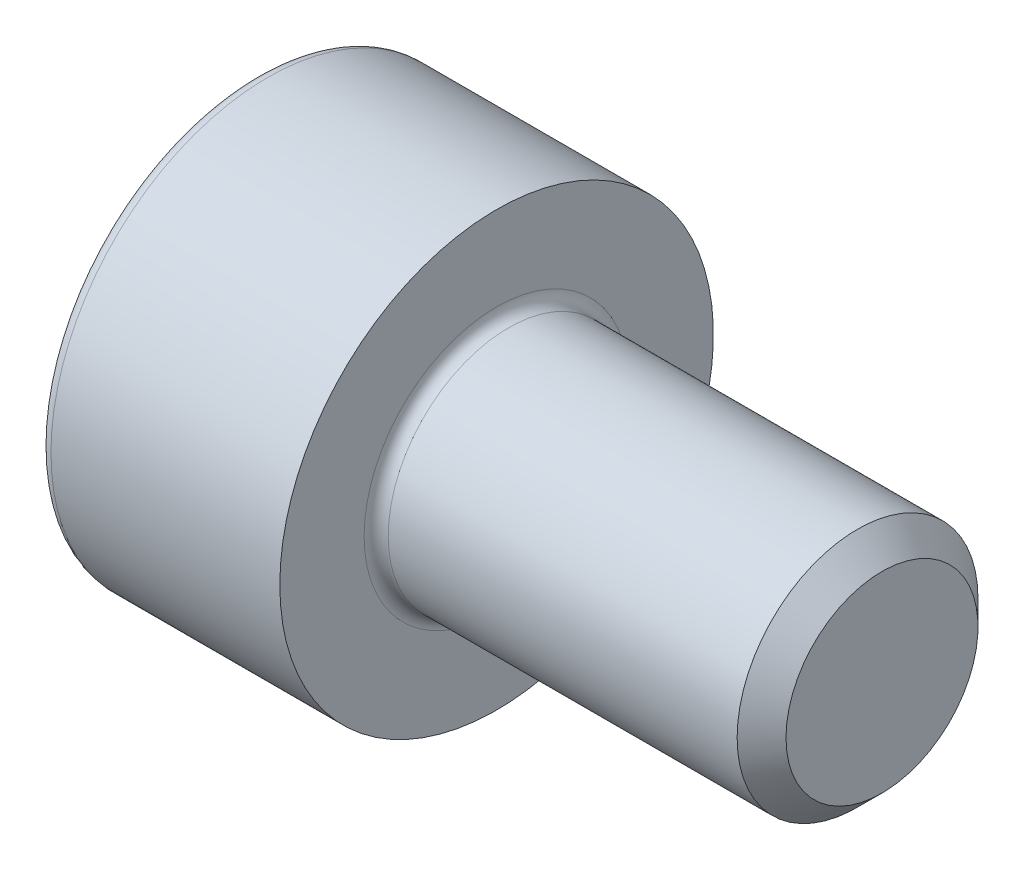
ISO-10303-21;
HEADER;
FILE_DESCRIPTION(('STEP AP214'),'2;1');
FILE_NAME('part.step','',(''),(''),'','','');
FILE_SCHEMA(('AUTOMOTIVE_DESIGN { 1 0 10303 214 1 1 1 1 }'));
ENDSEC;
DATA;
#1=APPLICATION_CONTEXT('core data for automotive mechanical design processes');
#2=APPLICATION_PROTOCOL_DEFINITION('international standard','automotive_design',2000,#1);
#3=PRODUCT_CONTEXT('',#1,'mechanical');
#4=PRODUCT('Part','Part','',(#3));
#5=PRODUCT_RELATED_PRODUCT_CATEGORY('part','',(#4));
#6=PRODUCT_DEFINITION_FORMATION('','',#4);
#7=PRODUCT_DEFINITION_CONTEXT('part definition',#1,'design');
#8=PRODUCT_DEFINITION('design','',#6,#7);
#9=PRODUCT_DEFINITION_SHAPE('','',#8);
#10=(LENGTH_UNIT() NAMED_UNIT(*) SI_UNIT(.MILLI.,.METRE.));
#11=(NAMED_UNIT(*) PLANE_ANGLE_UNIT() SI_UNIT($,.RADIAN.));
#12=(NAMED_UNIT(*) SI_UNIT($,.STERADIAN.) SOLID_ANGLE_UNIT());
#13=UNCERTAINTY_MEASURE_WITH_UNIT(LENGTH_MEASURE(1.E-05),#10,'distance_accuracy_value','');
#14=(GEOMETRIC_REPRESENTATION_CONTEXT(3) GLOBAL_UNCERTAINTY_ASSIGNED_CONTEXT((#13)) GLOBAL_UNIT_ASSIGNED_CONTEXT((#10,
#11,#12)) REPRESENTATION_CONTEXT('',''));
#15=CARTESIAN_POINT('',(0.,0.,0.));
#16=DIRECTION('',(0.,0.,1.));
#17=DIRECTION('',(1.,0.,0.));
#18=AXIS2_PLACEMENT_3D('',#15,#16,#17);
#19=CARTESIAN_POINT('',(4.,0.,0.));
#20=DIRECTION('',(-1.,0.,0.));
#21=DIRECTION('',(0.,0.,1.));
#22=AXIS2_PLACEMENT_3D('',#19,#20,#21);
#23=CONICAL_SURFACE('',#22,0.996499999993503,0.785398163397448);
#24=CARTESIAN_POINT('',(3.7464999999935,0.,0.));
#25=DIRECTION('',(-1.,0.,0.));
#26=DIRECTION('',(0.,0.,1.));
#27=AXIS2_PLACEMENT_3D('',#24,#25,#26);
#28=CIRCLE('',#27,1.25);
#29=CARTESIAN_POINT('',(3.7464999999935,0.,1.25));
#30=VERTEX_POINT('',#29);
#31=EDGE_CURVE('E11',#30,#30,#28,.T.);
#32=ORIENTED_EDGE('',*,*,#31,.F.);
#33=EDGE_LOOP('',(#32));
#34=FACE_BOUND('',#33,.T.);
#35=CARTESIAN_POINT('',(4.,0.,0.));
#36=DIRECTION('',(-1.,0.,0.));
#37=DIRECTION('',(0.,0.,1.));
#38=AXIS2_PLACEMENT_3D('',#35,#36,#37);
#39=CIRCLE('',#38,0.996499999993503);
#40=CARTESIAN_POINT('',(4.,0.,0.996499999993503));
#41=VERTEX_POINT('',#40);
#42=EDGE_CURVE('E133',#41,#41,#39,.T.);
#43=ORIENTED_EDGE('',*,*,#42,.T.);
#44=EDGE_LOOP('',(#43));
#45=FACE_BOUND('',#44,.T.);
#46=ADVANCED_FACE('F32',(#34,#45),#23,.T.);
#47=CARTESIAN_POINT('',(-2.5,0.,0.));
#48=DIRECTION('',(-1.,0.,0.));
#49=DIRECTION('',(0.,0.,1.));
#50=AXIS2_PLACEMENT_3D('',#47,#48,#49);
#51=CYLINDRICAL_SURFACE('',#50,1.25);
#52=CARTESIAN_POINT('',(0.125,0.,0.));
#53=DIRECTION('',(-1.,0.,0.));
#54=DIRECTION('',(0.,0.,1.));
#55=AXIS2_PLACEMENT_3D('',#52,#53,#54);
#56=CIRCLE('',#55,1.25);
#57=CARTESIAN_POINT('',(0.125,0.,1.25));
#58=VERTEX_POINT('',#57);
#59=EDGE_CURVE('E39',#58,#58,#56,.T.);
#60=ORIENTED_EDGE('',*,*,#59,.F.);
#61=EDGE_LOOP('',(#60));
#62=FACE_BOUND('',#61,.T.);
#63=ORIENTED_EDGE('',*,*,#31,.T.);
#64=EDGE_LOOP('',(#63));
#65=FACE_BOUND('',#64,.T.);
#66=ADVANCED_FACE('F157',(#62,#65),#51,.T.);
#67=CARTESIAN_POINT('',(0.125,0.,0.));
#68=DIRECTION('',(-1.,0.,0.));
#69=DIRECTION('',(0.,0.,1.));
#70=AXIS2_PLACEMENT_3D('',#67,#68,#69);
#71=TOROIDAL_SURFACE('',#70,1.375,0.125);
#72=CARTESIAN_POINT('',(0.,0.,0.));
#73=DIRECTION('',(-1.,0.,0.));
#74=DIRECTION('',(0.,0.,1.));
#75=AXIS2_PLACEMENT_3D('',#72,#73,#74);
#76=CIRCLE('',#75,1.375);
#77=CARTESIAN_POINT('',(0.,0.,1.375));
#78=VERTEX_POINT('',#77);
#79=EDGE_CURVE('E150',#78,#78,#76,.T.);
#80=ORIENTED_EDGE('',*,*,#79,.F.);
#81=EDGE_LOOP('',(#80));
#82=FACE_BOUND('',#81,.T.);
#83=ORIENTED_EDGE('',*,*,#59,.T.);
#84=EDGE_LOOP('',(#83));
#85=FACE_BOUND('',#84,.T.);
#86=ADVANCED_FACE('F155',(#82,#85),#71,.F.);
#87=CARTESIAN_POINT('',(0.,1.375,0.));
#88=DIRECTION('',(-1.,0.,0.));
#89=DIRECTION('',(0.,0.,1.));
#90=AXIS2_PLACEMENT_3D('',#87,#88,#89);
#91=PLANE('',#90);
#92=CARTESIAN_POINT('',(0.,0.,0.));
#93=DIRECTION('',(-1.,0.,0.));
#94=DIRECTION('',(0.,0.,1.));
#95=AXIS2_PLACEMENT_3D('',#92,#93,#94);
#96=CIRCLE('',#95,2.25);
#97=CARTESIAN_POINT('',(0.,0.,2.25));
#98=VERTEX_POINT('',#97);
#99=EDGE_CURVE('E147',#98,#98,#96,.T.);
#100=ORIENTED_EDGE('',*,*,#99,.F.);
#101=EDGE_LOOP('',(#100));
#102=FACE_BOUND('',#101,.T.);
#103=ORIENTED_EDGE('',*,*,#79,.T.);
#104=EDGE_LOOP('',(#103));
#105=FACE_BOUND('',#104,.T.);
#106=ADVANCED_FACE('F188',(#102,#105),#91,.F.);
#107=CARTESIAN_POINT('',(-2.5,0.,0.));
#108=DIRECTION('',(-1.,0.,0.));
#109=DIRECTION('',(0.,0.,1.));
#110=AXIS2_PLACEMENT_3D('',#107,#108,#109);
#111=CYLINDRICAL_SURFACE('',#110,2.25);
#112=CARTESIAN_POINT('',(-2.375,0.,0.));
#113=DIRECTION('',(-1.,0.,0.));
#114=DIRECTION('',(0.,0.,1.));
#115=AXIS2_PLACEMENT_3D('',#112,#113,#114);
#116=CIRCLE('',#115,2.25);
#117=CARTESIAN_POINT('',(-2.375,0.,2.25));
#118=VERTEX_POINT('',#117);
#119=EDGE_CURVE('E144',#118,#118,#116,.T.);
#120=ORIENTED_EDGE('',*,*,#119,.F.);
#121=EDGE_LOOP('',(#120));
#122=FACE_BOUND('',#121,.T.);
#123=ORIENTED_EDGE('',*,*,#99,.T.);
#124=EDGE_LOOP('',(#123));
#125=FACE_BOUND('',#124,.T.);
#126=ADVANCED_FACE('F184',(#122,#125),#111,.T.);
#127=CARTESIAN_POINT('',(-2.375,0.,0.));
#128=DIRECTION('',(-1.,0.,0.));
#129=DIRECTION('',(0.,0.,1.));
#130=AXIS2_PLACEMENT_3D('',#127,#128,#129);
#131=TOROIDAL_SURFACE('',#130,2.125,0.125);
#132=CARTESIAN_POINT('',(-2.5,0.,0.));
#133=DIRECTION('',(-1.,0.,0.));
#134=DIRECTION('',(0.,0.,1.));
#135=AXIS2_PLACEMENT_3D('',#132,#133,#134);
#136=CIRCLE('',#135,2.125);
#137=CARTESIAN_POINT('',(-2.5,0.,2.125));
#138=VERTEX_POINT('',#137);
#139=EDGE_CURVE('E141',#138,#138,#136,.T.);
#140=ORIENTED_EDGE('',*,*,#139,.F.);
#141=EDGE_LOOP('',(#140));
#142=FACE_BOUND('',#141,.T.);
#143=ORIENTED_EDGE('',*,*,#119,.T.);
#144=EDGE_LOOP('',(#143));
#145=FACE_BOUND('',#144,.T.);
#146=ADVANCED_FACE('F177',(#142,#145),#131,.T.);
#147=CARTESIAN_POINT('',(-2.5,2.125,0.));
#148=DIRECTION('',(1.,0.,0.));
#149=DIRECTION('',(0.,0.,-1.));
#150=AXIS2_PLACEMENT_3D('',#147,#148,#149);
#151=PLANE('',#150);
#152=DIRECTION('',(0.,0.5,-0.866025403784438));
#153=VECTOR('',#152,1.);
#154=CARTESIAN_POINT('',(-2.5,0.591784025919366,1.025));
#155=LINE('',#154,#153);
#156=CARTESIAN_POINT('',(-2.5,0.591784025919366,1.025));
#157=VERTEX_POINT('',#156);
#158=CARTESIAN_POINT('',(-2.5,1.18356805183873,0.));
#159=VERTEX_POINT('',#158);
#160=EDGE_CURVE('E120',#157,#159,#155,.T.);
#161=ORIENTED_EDGE('',*,*,#160,.F.);
#162=DIRECTION('',(0.,1.,0.));
#163=VECTOR('',#162,1.);
#164=CARTESIAN_POINT('',(-2.5,-0.591784025919367,1.025));
#165=LINE('',#164,#163);
#166=CARTESIAN_POINT('',(-2.5,-0.591784025919367,1.025));
#167=VERTEX_POINT('',#166);
#168=EDGE_CURVE('E46',#167,#157,#165,.T.);
#169=ORIENTED_EDGE('',*,*,#168,.F.);
#170=DIRECTION('',(0.,0.5,0.866025403784439));
#171=VECTOR('',#170,1.);
#172=CARTESIAN_POINT('',(-2.5,-1.18356805183873,0.));
#173=LINE('',#172,#171);
#174=CARTESIAN_POINT('',(-2.5,-1.18356805183873,0.));
#175=VERTEX_POINT('',#174);
#176=EDGE_CURVE('E129',#175,#167,#173,.T.);
#177=ORIENTED_EDGE('',*,*,#176,.F.);
#178=DIRECTION('',(0.,-0.5,0.866025403784438));
#179=VECTOR('',#178,1.);
#180=CARTESIAN_POINT('',(-2.5,-0.591784025919366,-1.025));
#181=LINE('',#180,#179);
#182=CARTESIAN_POINT('',(-2.5,-0.591784025919366,-1.025));
#183=VERTEX_POINT('',#182);
#184=EDGE_CURVE('E127',#183,#175,#181,.T.);
#185=ORIENTED_EDGE('',*,*,#184,.F.);
#186=DIRECTION('',(0.,-1.,0.));
#187=VECTOR('',#186,1.);
#188=CARTESIAN_POINT('',(-2.5,0.591784025919367,-1.025));
#189=LINE('',#188,#187);
#190=CARTESIAN_POINT('',(-2.5,0.591784025919367,-1.025));
#191=VERTEX_POINT('',#190);
#192=EDGE_CURVE('E94',#191,#183,#189,.T.);
#193=ORIENTED_EDGE('',*,*,#192,.F.);
#194=DIRECTION('',(0.,-0.5,-0.866025403784439));
#195=VECTOR('',#194,1.);
#196=CARTESIAN_POINT('',(-2.5,1.18356805183873,0.));
#197=LINE('',#196,#195);
#198=EDGE_CURVE('E123',#159,#191,#197,.T.);
#199=ORIENTED_EDGE('',*,*,#198,.F.);
#200=EDGE_LOOP('',(#161,#169,#177,#185,#193,#199));
#201=FACE_BOUND('',#200,.T.);
#202=ORIENTED_EDGE('',*,*,#139,.T.);
#203=EDGE_LOOP('',(#202));
#204=FACE_BOUND('',#203,.T.);
#205=ADVANCED_FACE('F169',(#201,#204),#151,.F.);
#206=CARTESIAN_POINT('',(4.,0.996499999993503,0.));
#207=DIRECTION('',(-1.,0.,0.));
#208=DIRECTION('',(0.,0.,1.));
#209=AXIS2_PLACEMENT_3D('',#206,#207,#208);
#210=PLANE('',#209);
#211=ORIENTED_EDGE('',*,*,#42,.F.);
#212=EDGE_LOOP('',(#211));
#213=FACE_BOUND('',#212,.T.);
#214=ADVANCED_FACE('F166',(#213),#210,.F.);
#215=CARTESIAN_POINT('',(-1.4,-0.591784025919367,1.025));
#216=DIRECTION('',(0.,0.,1.));
#217=DIRECTION('',(1.,0.,0.));
#218=AXIS2_PLACEMENT_3D('',#215,#216,#217);
#219=PLANE('',#218);
#220=ORIENTED_EDGE('',*,*,#168,.T.);
#221=DIRECTION('',(-1.,0.,0.));
#222=VECTOR('',#221,1.);
#223=CARTESIAN_POINT('',(-1.4,0.591784025919366,1.025));
#224=LINE('',#223,#222);
#225=CARTESIAN_POINT('',(-1.4,0.591784025919366,1.025));
#226=VERTEX_POINT('',#225);
#227=EDGE_CURVE('E76',#226,#157,#224,.T.);
#228=ORIENTED_EDGE('',*,*,#227,.F.);
#229=DIRECTION('',(0.,1.,0.));
#230=VECTOR('',#229,1.);
#231=CARTESIAN_POINT('',(-1.4,-0.591784025919367,1.025));
#232=LINE('',#231,#230);
#233=CARTESIAN_POINT('',(-1.4,-0.591784025919367,1.025));
#234=VERTEX_POINT('',#233);
#235=EDGE_CURVE('E131',#234,#226,#232,.T.);
#236=ORIENTED_EDGE('',*,*,#235,.F.);
#237=DIRECTION('',(-1.,0.,0.));
#238=VECTOR('',#237,1.);
#239=CARTESIAN_POINT('',(-1.4,-0.591784025919367,1.025));
#240=LINE('',#239,#238);
#241=EDGE_CURVE('E54',#234,#167,#240,.T.);
#242=ORIENTED_EDGE('',*,*,#241,.T.);
#243=EDGE_LOOP('',(#220,#228,#236,#242));
#244=FACE_BOUND('',#243,.T.);
#245=ADVANCED_FACE('F168',(#244),#219,.F.);
#246=CARTESIAN_POINT('',(-1.4,-1.18356805183873,0.));
#247=DIRECTION('',(0.,-0.866025403784439,0.5));
#248=DIRECTION('',(0.,-0.5,-0.866025403784439));
#249=AXIS2_PLACEMENT_3D('',#246,#247,#248);
#250=PLANE('',#249);
#251=ORIENTED_EDGE('',*,*,#176,.T.);
#252=ORIENTED_EDGE('',*,*,#241,.F.);
#253=DIRECTION('',(0.,0.5,0.866025403784439));
#254=VECTOR('',#253,1.);
#255=CARTESIAN_POINT('',(-1.4,-1.18356805183873,0.));
#256=LINE('',#255,#254);
#257=CARTESIAN_POINT('',(-1.4,-1.18356805183873,0.));
#258=VERTEX_POINT('',#257);
#259=EDGE_CURVE('E106',#258,#234,#256,.T.);
#260=ORIENTED_EDGE('',*,*,#259,.F.);
#261=DIRECTION('',(-1.,0.,0.));
#262=VECTOR('',#261,1.);
#263=CARTESIAN_POINT('',(-1.4,-1.18356805183873,0.));
#264=LINE('',#263,#262);
#265=EDGE_CURVE('E98',#258,#175,#264,.T.);
#266=ORIENTED_EDGE('',*,*,#265,.T.);
#267=EDGE_LOOP('',(#251,#252,#260,#266));
#268=FACE_BOUND('',#267,.T.);
#269=ADVANCED_FACE('F175',(#268),#250,.F.);
#270=CARTESIAN_POINT('',(-1.4,-0.591784025919366,-1.025));
#271=DIRECTION('',(0.,-0.866025403784439,-0.5));
#272=DIRECTION('',(0.,0.5,-0.866025403784438));
#273=AXIS2_PLACEMENT_3D('',#270,#271,#272);
#274=PLANE('',#273);
#275=ORIENTED_EDGE('',*,*,#184,.T.);
#276=ORIENTED_EDGE('',*,*,#265,.F.);
#277=DIRECTION('',(0.,-0.5,0.866025403784438));
#278=VECTOR('',#277,1.);
#279=CARTESIAN_POINT('',(-1.4,-0.591784025919366,-1.025));
#280=LINE('',#279,#278);
#281=CARTESIAN_POINT('',(-1.4,-0.591784025919366,-1.025));
#282=VERTEX_POINT('',#281);
#283=EDGE_CURVE('E102',#282,#258,#280,.T.);
#284=ORIENTED_EDGE('',*,*,#283,.F.);
#285=DIRECTION('',(-1.,0.,0.));
#286=VECTOR('',#285,1.);
#287=CARTESIAN_POINT('',(-1.4,-0.591784025919366,-1.025));
#288=LINE('',#287,#286);
#289=EDGE_CURVE('E87',#282,#183,#288,.T.);
#290=ORIENTED_EDGE('',*,*,#289,.T.);
#291=EDGE_LOOP('',(#275,#276,#284,#290));
#292=FACE_BOUND('',#291,.T.);
#293=ADVANCED_FACE('F103',(#292),#274,.F.);
#294=CARTESIAN_POINT('',(-1.4,0.591784025919367,-1.025));
#295=DIRECTION('',(0.,0.,-1.));
#296=DIRECTION('',(-1.,0.,0.));
#297=AXIS2_PLACEMENT_3D('',#294,#295,#296);
#298=PLANE('',#297);
#299=ORIENTED_EDGE('',*,*,#192,.T.);
#300=ORIENTED_EDGE('',*,*,#289,.F.);
#301=DIRECTION('',(0.,-1.,0.));
#302=VECTOR('',#301,1.);
#303=CARTESIAN_POINT('',(-1.4,0.591784025919367,-1.025));
#304=LINE('',#303,#302);
#305=CARTESIAN_POINT('',(-1.4,0.591784025919367,-1.025));
#306=VERTEX_POINT('',#305);
#307=EDGE_CURVE('E91',#306,#282,#304,.T.);
#308=ORIENTED_EDGE('',*,*,#307,.F.);
#309=DIRECTION('',(-1.,0.,0.));
#310=VECTOR('',#309,1.);
#311=CARTESIAN_POINT('',(-1.4,0.591784025919367,-1.025));
#312=LINE('',#311,#310);
#313=EDGE_CURVE('E99',#306,#191,#312,.T.);
#314=ORIENTED_EDGE('',*,*,#313,.T.);
#315=EDGE_LOOP('',(#299,#300,#308,#314));
#316=FACE_BOUND('',#315,.T.);
#317=ADVANCED_FACE('F89',(#316),#298,.F.);
#318=CARTESIAN_POINT('',(-1.4,1.18356805183873,0.));
#319=DIRECTION('',(0.,0.866025403784439,-0.5));
#320=DIRECTION('',(0.,0.5,0.866025403784439));
#321=AXIS2_PLACEMENT_3D('',#318,#319,#320);
#322=PLANE('',#321);
#323=ORIENTED_EDGE('',*,*,#198,.T.);
#324=ORIENTED_EDGE('',*,*,#313,.F.);
#325=DIRECTION('',(0.,-0.5,-0.866025403784439));
#326=VECTOR('',#325,1.);
#327=CARTESIAN_POINT('',(-1.4,1.18356805183873,0.));
#328=LINE('',#327,#326);
#329=CARTESIAN_POINT('',(-1.4,1.18356805183873,0.));
#330=VERTEX_POINT('',#329);
#331=EDGE_CURVE('E112',#330,#306,#328,.T.);
#332=ORIENTED_EDGE('',*,*,#331,.F.);
#333=DIRECTION('',(-1.,0.,0.));
#334=VECTOR('',#333,1.);
#335=CARTESIAN_POINT('',(-1.4,1.18356805183873,0.));
#336=LINE('',#335,#334);
#337=EDGE_CURVE('E136',#330,#159,#336,.T.);
#338=ORIENTED_EDGE('',*,*,#337,.T.);
#339=EDGE_LOOP('',(#323,#324,#332,#338));
#340=FACE_BOUND('',#339,.T.);
#341=ADVANCED_FACE('F250',(#340),#322,.F.);
#342=CARTESIAN_POINT('',(-1.4,0.591784025919366,1.025));
#343=DIRECTION('',(0.,0.866025403784439,0.5));
#344=DIRECTION('',(0.,-0.5,0.866025403784438));
#345=AXIS2_PLACEMENT_3D('',#342,#343,#344);
#346=PLANE('',#345);
#347=ORIENTED_EDGE('',*,*,#160,.T.);
#348=ORIENTED_EDGE('',*,*,#337,.F.);
#349=DIRECTION('',(0.,0.5,-0.866025403784438));
#350=VECTOR('',#349,1.);
#351=CARTESIAN_POINT('',(-1.4,0.591784025919366,1.025));
#352=LINE('',#351,#350);
#353=EDGE_CURVE('E114',#226,#330,#352,.T.);
#354=ORIENTED_EDGE('',*,*,#353,.F.);
#355=ORIENTED_EDGE('',*,*,#227,.T.);
#356=EDGE_LOOP('',(#347,#348,#354,#355));
#357=FACE_BOUND('',#356,.T.);
#358=ADVANCED_FACE('F259',(#357),#346,.F.);
#359=CARTESIAN_POINT('',(-1.4,0.,0.));
#360=DIRECTION('',(-1.,0.,0.));
#361=DIRECTION('',(0.,0.,1.));
#362=AXIS2_PLACEMENT_3D('',#359,#360,#361);
#363=PLANE('',#362);
#364=ORIENTED_EDGE('',*,*,#235,.T.);
#365=ORIENTED_EDGE('',*,*,#353,.T.);
#366=ORIENTED_EDGE('',*,*,#331,.T.);
#367=ORIENTED_EDGE('',*,*,#307,.T.);
#368=ORIENTED_EDGE('',*,*,#283,.T.);
#369=ORIENTED_EDGE('',*,*,#259,.T.);
#370=EDGE_LOOP('',(#364,#365,#366,#367,#368,#369));
#371=FACE_BOUND('',#370,.T.);
#372=ADVANCED_FACE('F109',(#371),#363,.T.);
#373=CLOSED_SHELL('',(#46,#66,#86,#106,#126,#146,#205,#214,#245,#269,#293,#317,#341,#358,#372));
#374=MANIFOLD_SOLID_BREP('B2',#373);
#375=ADVANCED_BREP_SHAPE_REPRESENTATION('',(#18,#374),#14);
#376=SHAPE_DEFINITION_REPRESENTATION(#9,#375);
ENDSEC;
END-ISO-10303-21;
